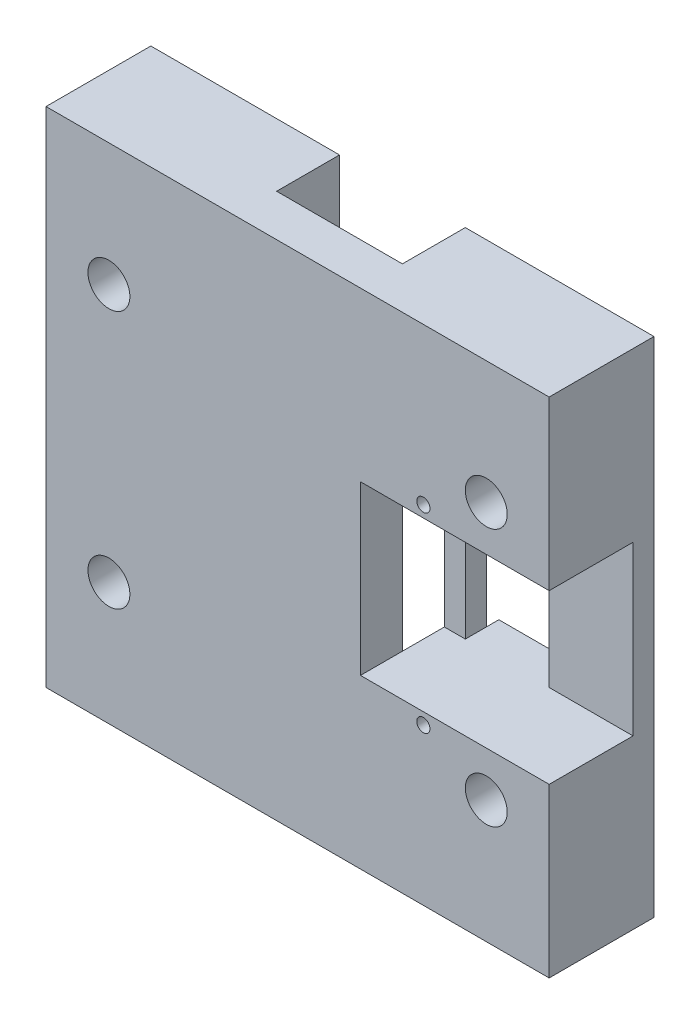
ISO-10303-21;
HEADER;
FILE_DESCRIPTION(('STEP AP214'),'2;1');
FILE_NAME('part.step','',(''),(''),'','','');
FILE_SCHEMA(('AUTOMOTIVE_DESIGN { 1 0 10303 214 1 1 1 1 }'));
ENDSEC;
DATA;
#1=APPLICATION_CONTEXT('core data for automotive mechanical design processes');
#2=APPLICATION_PROTOCOL_DEFINITION('international standard','automotive_design',2000,#1);
#3=PRODUCT_CONTEXT('',#1,'mechanical');
#4=PRODUCT('Part','Part','',(#3));
#5=PRODUCT_RELATED_PRODUCT_CATEGORY('part','',(#4));
#6=PRODUCT_DEFINITION_FORMATION('','',#4);
#7=PRODUCT_DEFINITION_CONTEXT('part definition',#1,'design');
#8=PRODUCT_DEFINITION('design','',#6,#7);
#9=PRODUCT_DEFINITION_SHAPE('','',#8);
#10=(LENGTH_UNIT() NAMED_UNIT(*) SI_UNIT(.MILLI.,.METRE.));
#11=(NAMED_UNIT(*) PLANE_ANGLE_UNIT() SI_UNIT($,.RADIAN.));
#12=(NAMED_UNIT(*) SI_UNIT($,.STERADIAN.) SOLID_ANGLE_UNIT());
#13=UNCERTAINTY_MEASURE_WITH_UNIT(LENGTH_MEASURE(1.E-05),#10,'distance_accuracy_value','');
#14=(GEOMETRIC_REPRESENTATION_CONTEXT(3) GLOBAL_UNCERTAINTY_ASSIGNED_CONTEXT((#13)) GLOBAL_UNIT_ASSIGNED_CONTEXT((#10,
#11,#12)) REPRESENTATION_CONTEXT('',''));
#15=CARTESIAN_POINT('',(0.,0.,0.));
#16=DIRECTION('',(0.,0.,1.));
#17=DIRECTION('',(1.,0.,0.));
#18=AXIS2_PLACEMENT_3D('',#15,#16,#17);
#19=CARTESIAN_POINT('',(25.4,16.1999999999999,0.));
#20=DIRECTION('',(1.,0.,0.));
#21=DIRECTION('',(0.,0.,-1.));
#22=AXIS2_PLACEMENT_3D('',#19,#20,#21);
#23=PLANE('',#22);
#24=DIRECTION('',(0.,0.,1.));
#25=VECTOR('',#24,1.);
#26=CARTESIAN_POINT('',(25.4,12.7,-11.43));
#27=LINE('',#26,#25);
#28=CARTESIAN_POINT('',(25.4,12.7,-9.525));
#29=VERTEX_POINT('',#28);
#30=CARTESIAN_POINT('',(25.4,12.7,-6.35));
#31=VERTEX_POINT('',#30);
#32=EDGE_CURVE('E764',#29,#31,#27,.T.);
#33=ORIENTED_EDGE('',*,*,#32,.F.);
#34=DIRECTION('',(0.,-1.,0.));
#35=VECTOR('',#34,1.);
#36=CARTESIAN_POINT('',(25.4,16.1999999999999,-9.525));
#37=LINE('',#36,#35);
#38=CARTESIAN_POINT('',(25.4,-12.7,-9.525));
#39=VERTEX_POINT('',#38);
#40=EDGE_CURVE('E278',#29,#39,#37,.T.);
#41=ORIENTED_EDGE('',*,*,#40,.T.);
#42=DIRECTION('',(0.,0.,1.));
#43=VECTOR('',#42,1.);
#44=CARTESIAN_POINT('',(25.4,-12.7,-11.43));
#45=LINE('',#44,#43);
#46=CARTESIAN_POINT('',(25.4,-12.7,-6.35));
#47=VERTEX_POINT('',#46);
#48=EDGE_CURVE('E264',#39,#47,#45,.T.);
#49=ORIENTED_EDGE('',*,*,#48,.T.);
#50=DIRECTION('',(0.,-1.,0.));
#51=VECTOR('',#50,1.);
#52=CARTESIAN_POINT('',(25.4,12.7,-6.35));
#53=LINE('',#52,#51);
#54=EDGE_CURVE('E299',#31,#47,#53,.T.);
#55=ORIENTED_EDGE('',*,*,#54,.F.);
#56=EDGE_LOOP('',(#33,#41,#49,#55));
#57=FACE_BOUND('',#56,.T.);
#58=ADVANCED_FACE('F41',(#57),#23,.F.);
#59=CARTESIAN_POINT('',(12.7,16.1999999999999,0.));
#60=DIRECTION('',(-1.,0.,0.));
#61=DIRECTION('',(0.,0.,1.));
#62=AXIS2_PLACEMENT_3D('',#59,#60,#61);
#63=PLANE('',#62);
#64=DIRECTION('',(0.,0.,1.));
#65=VECTOR('',#64,1.);
#66=CARTESIAN_POINT('',(12.7,12.7,-11.43));
#67=LINE('',#66,#65);
#68=CARTESIAN_POINT('',(12.7,12.7,-9.525));
#69=VERTEX_POINT('',#68);
#70=CARTESIAN_POINT('',(12.7,12.7,-6.35));
#71=VERTEX_POINT('',#70);
#72=EDGE_CURVE('E224',#69,#71,#67,.T.);
#73=ORIENTED_EDGE('',*,*,#72,.T.);
#74=DIRECTION('',(0.,1.,0.));
#75=VECTOR('',#74,1.);
#76=CARTESIAN_POINT('',(12.7,12.7,-6.35));
#77=LINE('',#76,#75);
#78=CARTESIAN_POINT('',(12.7,-12.7,-6.35));
#79=VERTEX_POINT('',#78);
#80=EDGE_CURVE('E295',#79,#71,#77,.T.);
#81=ORIENTED_EDGE('',*,*,#80,.F.);
#82=DIRECTION('',(0.,0.,1.));
#83=VECTOR('',#82,1.);
#84=CARTESIAN_POINT('',(12.7,-12.7,-11.43));
#85=LINE('',#84,#83);
#86=CARTESIAN_POINT('',(12.7,-12.7,-9.525));
#87=VERTEX_POINT('',#86);
#88=EDGE_CURVE('E251',#87,#79,#85,.T.);
#89=ORIENTED_EDGE('',*,*,#88,.F.);
#90=DIRECTION('',(0.,1.,0.));
#91=VECTOR('',#90,1.);
#92=CARTESIAN_POINT('',(12.7,16.1999999999999,-9.525));
#93=LINE('',#92,#91);
#94=EDGE_CURVE('E288',#87,#69,#93,.T.);
#95=ORIENTED_EDGE('',*,*,#94,.T.);
#96=EDGE_LOOP('',(#73,#81,#89,#95));
#97=FACE_BOUND('',#96,.T.);
#98=ADVANCED_FACE('F529',(#97),#63,.F.);
#99=CARTESIAN_POINT('',(66.4980633142473,12.7,-6.35));
#100=DIRECTION('',(0.,0.,-1.));
#101=DIRECTION('',(-1.,0.,0.));
#102=AXIS2_PLACEMENT_3D('',#99,#100,#101);
#103=PLANE('',#102);
#104=DIRECTION('',(-1.,0.,0.));
#105=VECTOR('',#104,1.);
#106=CARTESIAN_POINT('',(66.4980633142473,12.7,-6.35));
#107=LINE('',#106,#105);
#108=CARTESIAN_POINT('',(38.1,12.7,-6.35));
#109=VERTEX_POINT('',#108);
#110=EDGE_CURVE('E308',#109,#31,#107,.T.);
#111=ORIENTED_EDGE('',*,*,#110,.T.);
#112=ORIENTED_EDGE('',*,*,#54,.T.);
#113=DIRECTION('',(-1.,0.,0.));
#114=VECTOR('',#113,1.);
#115=CARTESIAN_POINT('',(66.4980633142473,-12.7,-6.35));
#116=LINE('',#115,#114);
#117=CARTESIAN_POINT('',(38.1,-12.7,-6.35));
#118=VERTEX_POINT('',#117);
#119=EDGE_CURVE('E335',#118,#47,#116,.T.);
#120=ORIENTED_EDGE('',*,*,#119,.F.);
#121=DIRECTION('',(0.,1.,0.));
#122=VECTOR('',#121,1.);
#123=CARTESIAN_POINT('',(38.1,12.7,-6.35));
#124=LINE('',#123,#122);
#125=EDGE_CURVE('E307',#118,#109,#124,.T.);
#126=ORIENTED_EDGE('',*,*,#125,.T.);
#127=EDGE_LOOP('',(#111,#112,#120,#126));
#128=FACE_BOUND('',#127,.T.);
#129=ADVANCED_FACE('F537',(#128),#103,.F.);
#130=CARTESIAN_POINT('',(0.,0.,0.));
#131=DIRECTION('',(0.,0.,-1.));
#132=DIRECTION('',(-1.,0.,0.));
#133=AXIS2_PLACEMENT_3D('',#130,#131,#132);
#134=PLANE('',#133);
#135=DIRECTION('',(1.,0.,0.));
#136=VECTOR('',#135,1.);
#137=CARTESIAN_POINT('',(38.1,-38.1,0.));
#138=LINE('',#137,#136);
#139=CARTESIAN_POINT('',(-9.525,-38.1,0.));
#140=VERTEX_POINT('',#139);
#141=CARTESIAN_POINT('',(9.52500000000001,-38.1,0.));
#142=VERTEX_POINT('',#141);
#143=EDGE_CURVE('E426',#140,#142,#138,.T.);
#144=ORIENTED_EDGE('',*,*,#143,.F.);
#145=DIRECTION('',(0.,-1.,0.));
#146=VECTOR('',#145,1.);
#147=CARTESIAN_POINT('',(-9.525,0.,0.));
#148=LINE('',#147,#146);
#149=CARTESIAN_POINT('',(-9.525,38.1,0.));
#150=VERTEX_POINT('',#149);
#151=EDGE_CURVE('E341',#150,#140,#148,.T.);
#152=ORIENTED_EDGE('',*,*,#151,.F.);
#153=DIRECTION('',(-1.,0.,0.));
#154=VECTOR('',#153,1.);
#155=CARTESIAN_POINT('',(38.1,38.1,0.));
#156=LINE('',#155,#154);
#157=CARTESIAN_POINT('',(9.525,38.1,0.));
#158=VERTEX_POINT('',#157);
#159=EDGE_CURVE('E432',#158,#150,#156,.T.);
#160=ORIENTED_EDGE('',*,*,#159,.F.);
#161=DIRECTION('',(0.,-1.,0.));
#162=VECTOR('',#161,1.);
#163=CARTESIAN_POINT('',(9.525,0.,0.));
#164=LINE('',#163,#162);
#165=CARTESIAN_POINT('',(9.525,12.7,0.));
#166=VERTEX_POINT('',#165);
#167=EDGE_CURVE('E380',#158,#166,#164,.T.);
#168=ORIENTED_EDGE('',*,*,#167,.T.);
#169=CARTESIAN_POINT('',(9.525,-12.7,0.));
#170=VERTEX_POINT('',#169);
#171=EDGE_CURVE('E403',#166,#170,#164,.T.);
#172=ORIENTED_EDGE('',*,*,#171,.T.);
#173=EDGE_CURVE('E374',#170,#142,#164,.T.);
#174=ORIENTED_EDGE('',*,*,#173,.T.);
#175=EDGE_LOOP('',(#144,#152,#160,#168,#172,#174));
#176=FACE_BOUND('',#175,.T.);
#177=ADVANCED_FACE('F481',(#176),#134,.T.);
#178=CARTESIAN_POINT('',(0.,0.,6.35));
#179=DIRECTION('',(0.,0.,-1.));
#180=DIRECTION('',(-1.,0.,0.));
#181=AXIS2_PLACEMENT_3D('',#178,#179,#180);
#182=PLANE('',#181);
#183=CARTESIAN_POINT('',(19.05,14.45,6.35));
#184=DIRECTION('',(0.,0.,-1.));
#185=DIRECTION('',(-1.,0.,0.));
#186=AXIS2_PLACEMENT_3D('',#183,#184,#185);
#187=CIRCLE('',#186,1.);
#188=CARTESIAN_POINT('',(18.05,14.45,6.35));
#189=VERTEX_POINT('',#188);
#190=EDGE_CURVE('E274',#189,#189,#187,.F.);
#191=ORIENTED_EDGE('',*,*,#190,.F.);
#192=EDGE_LOOP('',(#191));
#193=FACE_BOUND('',#192,.T.);
#194=CARTESIAN_POINT('',(19.05,-14.45,6.35));
#195=DIRECTION('',(0.,0.,-1.));
#196=DIRECTION('',(-1.,0.,0.));
#197=AXIS2_PLACEMENT_3D('',#194,#195,#196);
#198=CIRCLE('',#197,1.);
#199=CARTESIAN_POINT('',(18.05,-14.45,6.35));
#200=VERTEX_POINT('',#199);
#201=EDGE_CURVE('E273',#200,#200,#198,.F.);
#202=ORIENTED_EDGE('',*,*,#201,.F.);
#203=EDGE_LOOP('',(#202));
#204=FACE_BOUND('',#203,.T.);
#205=DIRECTION('',(0.,1.,0.));
#206=VECTOR('',#205,1.);
#207=CARTESIAN_POINT('',(9.525,12.7,6.35));
#208=LINE('',#207,#206);
#209=CARTESIAN_POINT('',(9.525,-12.7,6.35));
#210=VERTEX_POINT('',#209);
#211=CARTESIAN_POINT('',(9.525,12.7,6.35));
#212=VERTEX_POINT('',#211);
#213=EDGE_CURVE('E318',#210,#212,#208,.T.);
#214=ORIENTED_EDGE('',*,*,#213,.T.);
#215=DIRECTION('',(-1.,0.,0.));
#216=VECTOR('',#215,1.);
#217=CARTESIAN_POINT('',(66.4980633142473,12.7,6.35));
#218=LINE('',#217,#216);
#219=CARTESIAN_POINT('',(38.1,12.7,6.35));
#220=VERTEX_POINT('',#219);
#221=EDGE_CURVE('E330',#220,#212,#218,.T.);
#222=ORIENTED_EDGE('',*,*,#221,.F.);
#223=DIRECTION('',(0.,1.,0.));
#224=VECTOR('',#223,1.);
#225=CARTESIAN_POINT('',(38.1,38.1,6.35));
#226=LINE('',#225,#224);
#227=CARTESIAN_POINT('',(38.1,38.1,6.35));
#228=VERTEX_POINT('',#227);
#229=EDGE_CURVE('E435',#220,#228,#226,.T.);
#230=ORIENTED_EDGE('',*,*,#229,.T.);
#231=DIRECTION('',(-1.,0.,0.));
#232=VECTOR('',#231,1.);
#233=CARTESIAN_POINT('',(38.1,38.1,6.35));
#234=LINE('',#233,#232);
#235=CARTESIAN_POINT('',(-38.1,38.1,6.35));
#236=VERTEX_POINT('',#235);
#237=EDGE_CURVE('E440',#228,#236,#234,.T.);
#238=ORIENTED_EDGE('',*,*,#237,.T.);
#239=DIRECTION('',(0.,-1.,0.));
#240=VECTOR('',#239,1.);
#241=CARTESIAN_POINT('',(-38.1,38.1,6.35));
#242=LINE('',#241,#240);
#243=CARTESIAN_POINT('',(-38.1,-38.1,6.35));
#244=VERTEX_POINT('',#243);
#245=EDGE_CURVE('E427',#236,#244,#242,.T.);
#246=ORIENTED_EDGE('',*,*,#245,.T.);
#247=DIRECTION('',(1.,0.,0.));
#248=VECTOR('',#247,1.);
#249=CARTESIAN_POINT('',(38.1,-38.1,6.35));
#250=LINE('',#249,#248);
#251=CARTESIAN_POINT('',(38.1,-38.1,6.35));
#252=VERTEX_POINT('',#251);
#253=EDGE_CURVE('E431',#244,#252,#250,.T.);
#254=ORIENTED_EDGE('',*,*,#253,.T.);
#255=CARTESIAN_POINT('',(38.1,-12.7,6.35));
#256=VERTEX_POINT('',#255);
#257=EDGE_CURVE('E436',#252,#256,#226,.T.);
#258=ORIENTED_EDGE('',*,*,#257,.T.);
#259=DIRECTION('',(-1.,0.,0.));
#260=VECTOR('',#259,1.);
#261=CARTESIAN_POINT('',(66.4980633142473,-12.7,6.35));
#262=LINE('',#261,#260);
#263=EDGE_CURVE('E57',#256,#210,#262,.T.);
#264=ORIENTED_EDGE('',*,*,#263,.T.);
#265=EDGE_LOOP('',(#214,#222,#230,#238,#246,#254,#258,#264));
#266=FACE_BOUND('',#265,.T.);
#267=CARTESIAN_POINT('',(-28.575,19.525,6.35));
#268=DIRECTION('',(0.,0.,1.));
#269=DIRECTION('',(1.,0.,0.));
#270=AXIS2_PLACEMENT_3D('',#267,#268,#269);
#271=CIRCLE('',#270,3.175);
#272=CARTESIAN_POINT('',(-25.4,19.525,6.35));
#273=VERTEX_POINT('',#272);
#274=EDGE_CURVE('E422',#273,#273,#271,.T.);
#275=ORIENTED_EDGE('',*,*,#274,.F.);
#276=EDGE_LOOP('',(#275));
#277=FACE_BOUND('',#276,.T.);
#278=CARTESIAN_POINT('',(28.575,19.525,6.35));
#279=DIRECTION('',(0.,0.,1.));
#280=DIRECTION('',(1.,0.,0.));
#281=AXIS2_PLACEMENT_3D('',#278,#279,#280);
#282=CIRCLE('',#281,3.175);
#283=CARTESIAN_POINT('',(31.75,19.525,6.35));
#284=VERTEX_POINT('',#283);
#285=EDGE_CURVE('E418',#284,#284,#282,.T.);
#286=ORIENTED_EDGE('',*,*,#285,.F.);
#287=EDGE_LOOP('',(#286));
#288=FACE_BOUND('',#287,.T.);
#289=CARTESIAN_POINT('',(28.575,-19.525,6.35));
#290=DIRECTION('',(0.,0.,1.));
#291=DIRECTION('',(1.,0.,0.));
#292=AXIS2_PLACEMENT_3D('',#289,#290,#291);
#293=CIRCLE('',#292,3.175);
#294=CARTESIAN_POINT('',(31.75,-19.525,6.35));
#295=VERTEX_POINT('',#294);
#296=EDGE_CURVE('E414',#295,#295,#293,.T.);
#297=ORIENTED_EDGE('',*,*,#296,.F.);
#298=EDGE_LOOP('',(#297));
#299=FACE_BOUND('',#298,.T.);
#300=CARTESIAN_POINT('',(-28.575,-19.525,6.35));
#301=DIRECTION('',(0.,0.,1.));
#302=DIRECTION('',(1.,0.,0.));
#303=AXIS2_PLACEMENT_3D('',#300,#301,#302);
#304=CIRCLE('',#303,3.175);
#305=CARTESIAN_POINT('',(-25.4,-19.525,6.35));
#306=VERTEX_POINT('',#305);
#307=EDGE_CURVE('E410',#306,#306,#304,.T.);
#308=ORIENTED_EDGE('',*,*,#307,.F.);
#309=EDGE_LOOP('',(#308));
#310=FACE_BOUND('',#309,.T.);
#311=ADVANCED_FACE('F503',(#193,#204,#266,#277,#288,#299,#310),#182,.F.);
#312=CARTESIAN_POINT('',(-38.1,38.1,6.35));
#313=DIRECTION('',(1.,0.,0.));
#314=DIRECTION('',(0.,1.,0.));
#315=AXIS2_PLACEMENT_3D('',#312,#313,#314);
#316=PLANE('',#315);
#317=DIRECTION('',(0.,0.,-1.));
#318=VECTOR('',#317,1.);
#319=CARTESIAN_POINT('',(-38.1,38.1,6.35));
#320=LINE('',#319,#318);
#321=CARTESIAN_POINT('',(-38.1,38.1,-9.525));
#322=VERTEX_POINT('',#321);
#323=EDGE_CURVE('E443',#236,#322,#320,.T.);
#324=ORIENTED_EDGE('',*,*,#323,.T.);
#325=DIRECTION('',(0.,1.,0.));
#326=VECTOR('',#325,1.);
#327=CARTESIAN_POINT('',(-38.1,0.,-9.525));
#328=LINE('',#327,#326);
#329=CARTESIAN_POINT('',(-38.1,-38.1,-9.525));
#330=VERTEX_POINT('',#329);
#331=EDGE_CURVE('E361',#330,#322,#328,.T.);
#332=ORIENTED_EDGE('',*,*,#331,.F.);
#333=DIRECTION('',(0.,0.,-1.));
#334=VECTOR('',#333,1.);
#335=CARTESIAN_POINT('',(-38.1,-38.1,6.35));
#336=LINE('',#335,#334);
#337=EDGE_CURVE('E50',#244,#330,#336,.T.);
#338=ORIENTED_EDGE('',*,*,#337,.F.);
#339=ORIENTED_EDGE('',*,*,#245,.F.);
#340=EDGE_LOOP('',(#324,#332,#338,#339));
#341=FACE_BOUND('',#340,.T.);
#342=ADVANCED_FACE('F43',(#341),#316,.F.);
#343=CARTESIAN_POINT('',(38.1,-38.1,6.35));
#344=DIRECTION('',(0.,1.,0.));
#345=DIRECTION('',(-1.,0.,0.));
#346=AXIS2_PLACEMENT_3D('',#343,#344,#345);
#347=PLANE('',#346);
#348=ORIENTED_EDGE('',*,*,#337,.T.);
#349=DIRECTION('',(-1.,0.,0.));
#350=VECTOR('',#349,1.);
#351=CARTESIAN_POINT('',(0.,-38.1,-9.525));
#352=LINE('',#351,#350);
#353=CARTESIAN_POINT('',(-9.525,-38.1,-9.525));
#354=VERTEX_POINT('',#353);
#355=EDGE_CURVE('E357',#354,#330,#352,.T.);
#356=ORIENTED_EDGE('',*,*,#355,.F.);
#357=DIRECTION('',(0.,0.,1.));
#358=VECTOR('',#357,1.);
#359=CARTESIAN_POINT('',(-9.525,-38.1,-9.525));
#360=LINE('',#359,#358);
#361=EDGE_CURVE('E365',#354,#140,#360,.T.);
#362=ORIENTED_EDGE('',*,*,#361,.T.);
#363=ORIENTED_EDGE('',*,*,#143,.T.);
#364=DIRECTION('',(0.,0.,1.));
#365=VECTOR('',#364,1.);
#366=CARTESIAN_POINT('',(9.525,-38.1,-9.525));
#367=LINE('',#366,#365);
#368=CARTESIAN_POINT('',(9.525,-38.1,-9.525));
#369=VERTEX_POINT('',#368);
#370=EDGE_CURVE('E399',#369,#142,#367,.T.);
#371=ORIENTED_EDGE('',*,*,#370,.F.);
#372=DIRECTION('',(-1.,0.,0.));
#373=VECTOR('',#372,1.);
#374=CARTESIAN_POINT('',(0.,-38.1,-9.525));
#375=LINE('',#374,#373);
#376=CARTESIAN_POINT('',(38.1,-38.1,-9.525));
#377=VERTEX_POINT('',#376);
#378=EDGE_CURVE('E388',#377,#369,#375,.T.);
#379=ORIENTED_EDGE('',*,*,#378,.F.);
#380=DIRECTION('',(0.,0.,-1.));
#381=VECTOR('',#380,1.);
#382=CARTESIAN_POINT('',(38.1,-38.1,6.35));
#383=LINE('',#382,#381);
#384=EDGE_CURVE('E455',#252,#377,#383,.T.);
#385=ORIENTED_EDGE('',*,*,#384,.F.);
#386=ORIENTED_EDGE('',*,*,#253,.F.);
#387=EDGE_LOOP('',(#348,#356,#362,#363,#371,#379,#385,#386));
#388=FACE_BOUND('',#387,.T.);
#389=ADVANCED_FACE('F461',(#388),#347,.F.);
#390=CARTESIAN_POINT('',(38.1,38.1,6.35));
#391=DIRECTION('',(-1.,0.,0.));
#392=DIRECTION('',(0.,-1.,0.));
#393=AXIS2_PLACEMENT_3D('',#390,#391,#392);
#394=PLANE('',#393);
#395=ORIENTED_EDGE('',*,*,#229,.F.);
#396=DIRECTION('',(0.,0.,1.));
#397=VECTOR('',#396,1.);
#398=CARTESIAN_POINT('',(38.1,12.7,6.35));
#399=LINE('',#398,#397);
#400=EDGE_CURVE('E304',#109,#220,#399,.T.);
#401=ORIENTED_EDGE('',*,*,#400,.F.);
#402=ORIENTED_EDGE('',*,*,#125,.F.);
#403=DIRECTION('',(0.,0.,-1.));
#404=VECTOR('',#403,1.);
#405=CARTESIAN_POINT('',(38.1,-12.7,6.35));
#406=LINE('',#405,#404);
#407=EDGE_CURVE('E311',#256,#118,#406,.T.);
#408=ORIENTED_EDGE('',*,*,#407,.F.);
#409=ORIENTED_EDGE('',*,*,#257,.F.);
#410=ORIENTED_EDGE('',*,*,#384,.T.);
#411=DIRECTION('',(0.,-1.,0.));
#412=VECTOR('',#411,1.);
#413=CARTESIAN_POINT('',(38.1,0.,-9.525));
#414=LINE('',#413,#412);
#415=CARTESIAN_POINT('',(38.1,38.1,-9.525));
#416=VERTEX_POINT('',#415);
#417=EDGE_CURVE('E384',#416,#377,#414,.T.);
#418=ORIENTED_EDGE('',*,*,#417,.F.);
#419=DIRECTION('',(0.,0.,-1.));
#420=VECTOR('',#419,1.);
#421=CARTESIAN_POINT('',(38.1,38.1,6.35));
#422=LINE('',#421,#420);
#423=EDGE_CURVE('E452',#228,#416,#422,.T.);
#424=ORIENTED_EDGE('',*,*,#423,.F.);
#425=EDGE_LOOP('',(#395,#401,#402,#408,#409,#410,#418,#424));
#426=FACE_BOUND('',#425,.T.);
#427=ADVANCED_FACE('F500',(#426),#394,.F.);
#428=CARTESIAN_POINT('',(38.1,38.1,6.35));
#429=DIRECTION('',(0.,-1.,0.));
#430=DIRECTION('',(1.,0.,0.));
#431=AXIS2_PLACEMENT_3D('',#428,#429,#430);
#432=PLANE('',#431);
#433=ORIENTED_EDGE('',*,*,#423,.T.);
#434=DIRECTION('',(1.,0.,0.));
#435=VECTOR('',#434,1.);
#436=CARTESIAN_POINT('',(0.,38.1,-9.525));
#437=LINE('',#436,#435);
#438=CARTESIAN_POINT('',(9.525,38.1,-9.525));
#439=VERTEX_POINT('',#438);
#440=EDGE_CURVE('E379',#439,#416,#437,.T.);
#441=ORIENTED_EDGE('',*,*,#440,.F.);
#442=DIRECTION('',(0.,0.,1.));
#443=VECTOR('',#442,1.);
#444=CARTESIAN_POINT('',(9.525,38.1,-9.525));
#445=LINE('',#444,#443);
#446=EDGE_CURVE('E407',#439,#158,#445,.T.);
#447=ORIENTED_EDGE('',*,*,#446,.T.);
#448=ORIENTED_EDGE('',*,*,#159,.T.);
#449=DIRECTION('',(0.,0.,1.));
#450=VECTOR('',#449,1.);
#451=CARTESIAN_POINT('',(-9.525,38.1,-9.525));
#452=LINE('',#451,#450);
#453=CARTESIAN_POINT('',(-9.525,38.1,-9.525));
#454=VERTEX_POINT('',#453);
#455=EDGE_CURVE('E371',#454,#150,#452,.T.);
#456=ORIENTED_EDGE('',*,*,#455,.F.);
#457=DIRECTION('',(1.,0.,0.));
#458=VECTOR('',#457,1.);
#459=CARTESIAN_POINT('',(0.,38.1,-9.525));
#460=LINE('',#459,#458);
#461=EDGE_CURVE('E350',#322,#454,#460,.T.);
#462=ORIENTED_EDGE('',*,*,#461,.F.);
#463=ORIENTED_EDGE('',*,*,#323,.F.);
#464=ORIENTED_EDGE('',*,*,#237,.F.);
#465=EDGE_LOOP('',(#433,#441,#447,#448,#456,#462,#463,#464));
#466=FACE_BOUND('',#465,.T.);
#467=ADVANCED_FACE('F473',(#466),#432,.F.);
#468=CARTESIAN_POINT('',(-28.575,19.525,6.35));
#469=DIRECTION('',(0.,0.,-1.));
#470=DIRECTION('',(-1.,0.,0.));
#471=AXIS2_PLACEMENT_3D('',#468,#469,#470);
#472=CYLINDRICAL_SURFACE('',#471,3.175);
#473=ORIENTED_EDGE('',*,*,#274,.T.);
#474=EDGE_LOOP('',(#473));
#475=FACE_BOUND('',#474,.T.);
#476=CARTESIAN_POINT('',(-28.575,19.525,-9.525));
#477=DIRECTION('',(0.,0.,-1.));
#478=DIRECTION('',(-1.,0.,0.));
#479=AXIS2_PLACEMENT_3D('',#476,#477,#478);
#480=CIRCLE('',#479,3.175);
#481=CARTESIAN_POINT('',(-31.75,19.525,-9.525));
#482=VERTEX_POINT('',#481);
#483=EDGE_CURVE('E346',#482,#482,#480,.F.);
#484=ORIENTED_EDGE('',*,*,#483,.F.);
#485=EDGE_LOOP('',(#484));
#486=FACE_BOUND('',#485,.T.);
#487=ADVANCED_FACE('F610',(#475,#486),#472,.F.);
#488=CARTESIAN_POINT('',(28.575,19.525,6.35));
#489=DIRECTION('',(0.,0.,-1.));
#490=DIRECTION('',(-1.,0.,0.));
#491=AXIS2_PLACEMENT_3D('',#488,#489,#490);
#492=CYLINDRICAL_SURFACE('',#491,3.175);
#493=ORIENTED_EDGE('',*,*,#285,.T.);
#494=EDGE_LOOP('',(#493));
#495=FACE_BOUND('',#494,.T.);
#496=CARTESIAN_POINT('',(28.575,19.525,-9.525));
#497=DIRECTION('',(0.,0.,-1.));
#498=DIRECTION('',(-1.,0.,0.));
#499=AXIS2_PLACEMENT_3D('',#496,#497,#498);
#500=CIRCLE('',#499,3.175);
#501=CARTESIAN_POINT('',(25.4,19.525,-9.525));
#502=VERTEX_POINT('',#501);
#503=EDGE_CURVE('E391',#502,#502,#500,.F.);
#504=ORIENTED_EDGE('',*,*,#503,.F.);
#505=EDGE_LOOP('',(#504));
#506=FACE_BOUND('',#505,.T.);
#507=ADVANCED_FACE('F606',(#495,#506),#492,.F.);
#508=CARTESIAN_POINT('',(28.575,-19.525,6.35));
#509=DIRECTION('',(0.,0.,-1.));
#510=DIRECTION('',(-1.,0.,0.));
#511=AXIS2_PLACEMENT_3D('',#508,#509,#510);
#512=CYLINDRICAL_SURFACE('',#511,3.175);
#513=ORIENTED_EDGE('',*,*,#296,.T.);
#514=EDGE_LOOP('',(#513));
#515=FACE_BOUND('',#514,.T.);
#516=CARTESIAN_POINT('',(28.575,-19.525,-9.525));
#517=DIRECTION('',(0.,0.,-1.));
#518=DIRECTION('',(-1.,0.,0.));
#519=AXIS2_PLACEMENT_3D('',#516,#517,#518);
#520=CIRCLE('',#519,3.175);
#521=CARTESIAN_POINT('',(25.4,-19.525,-9.525));
#522=VERTEX_POINT('',#521);
#523=EDGE_CURVE('E395',#522,#522,#520,.F.);
#524=ORIENTED_EDGE('',*,*,#523,.F.);
#525=EDGE_LOOP('',(#524));
#526=FACE_BOUND('',#525,.T.);
#527=ADVANCED_FACE('F602',(#515,#526),#512,.F.);
#528=CARTESIAN_POINT('',(-28.575,-19.525,6.35));
#529=DIRECTION('',(0.,0.,-1.));
#530=DIRECTION('',(-1.,0.,0.));
#531=AXIS2_PLACEMENT_3D('',#528,#529,#530);
#532=CYLINDRICAL_SURFACE('',#531,3.175);
#533=ORIENTED_EDGE('',*,*,#307,.T.);
#534=EDGE_LOOP('',(#533));
#535=FACE_BOUND('',#534,.T.);
#536=CARTESIAN_POINT('',(-28.575,-19.525,-9.525));
#537=DIRECTION('',(0.,0.,-1.));
#538=DIRECTION('',(-1.,0.,0.));
#539=AXIS2_PLACEMENT_3D('',#536,#537,#538);
#540=CIRCLE('',#539,3.175);
#541=CARTESIAN_POINT('',(-31.75,-19.525,-9.525));
#542=VERTEX_POINT('',#541);
#543=EDGE_CURVE('E342',#542,#542,#540,.F.);
#544=ORIENTED_EDGE('',*,*,#543,.F.);
#545=EDGE_LOOP('',(#544));
#546=FACE_BOUND('',#545,.T.);
#547=ADVANCED_FACE('F599',(#535,#546),#532,.F.);
#548=CARTESIAN_POINT('',(9.525,0.,-9.525));
#549=DIRECTION('',(-1.,0.,0.));
#550=DIRECTION('',(0.,0.,1.));
#551=AXIS2_PLACEMENT_3D('',#548,#549,#550);
#552=PLANE('',#551);
#553=DIRECTION('',(0.,0.,-1.));
#554=VECTOR('',#553,1.);
#555=CARTESIAN_POINT('',(9.525,12.7,-9.525));
#556=LINE('',#555,#554);
#557=CARTESIAN_POINT('',(9.525,12.7,-6.35));
#558=VERTEX_POINT('',#557);
#559=EDGE_CURVE('E11',#166,#558,#556,.T.);
#560=ORIENTED_EDGE('',*,*,#559,.F.);
#561=ORIENTED_EDGE('',*,*,#167,.F.);
#562=ORIENTED_EDGE('',*,*,#446,.F.);
#563=DIRECTION('',(0.,-1.,0.));
#564=VECTOR('',#563,1.);
#565=CARTESIAN_POINT('',(9.525,0.,-9.525));
#566=LINE('',#565,#564);
#567=EDGE_CURVE('E375',#439,#369,#566,.T.);
#568=ORIENTED_EDGE('',*,*,#567,.T.);
#569=ORIENTED_EDGE('',*,*,#370,.T.);
#570=ORIENTED_EDGE('',*,*,#173,.F.);
#571=DIRECTION('',(0.,0.,1.));
#572=VECTOR('',#571,1.);
#573=CARTESIAN_POINT('',(9.525,-12.7,6.35));
#574=LINE('',#573,#572);
#575=CARTESIAN_POINT('',(9.525,-12.7,-6.35));
#576=VERTEX_POINT('',#575);
#577=EDGE_CURVE('E315',#576,#170,#574,.T.);
#578=ORIENTED_EDGE('',*,*,#577,.F.);
#579=DIRECTION('',(0.,-1.,0.));
#580=VECTOR('',#579,1.);
#581=CARTESIAN_POINT('',(9.525,12.7,-6.35));
#582=LINE('',#581,#580);
#583=EDGE_CURVE('E303',#558,#576,#582,.T.);
#584=ORIENTED_EDGE('',*,*,#583,.F.);
#585=EDGE_LOOP('',(#560,#561,#562,#568,#569,#570,#578,#584));
#586=FACE_BOUND('',#585,.T.);
#587=ADVANCED_FACE('F488',(#586),#552,.T.);
#588=CARTESIAN_POINT('',(0.,0.,-9.525));
#589=DIRECTION('',(0.,0.,-1.));
#590=DIRECTION('',(-1.,0.,0.));
#591=AXIS2_PLACEMENT_3D('',#588,#589,#590);
#592=PLANE('',#591);
#593=CARTESIAN_POINT('',(25.4,16.1999999999999,-9.525));
#594=VERTEX_POINT('',#593);
#595=EDGE_CURVE('E282',#594,#29,#37,.T.);
#596=ORIENTED_EDGE('',*,*,#595,.F.);
#597=DIRECTION('',(1.,0.,0.));
#598=VECTOR('',#597,1.);
#599=CARTESIAN_POINT('',(12.7,16.1999999999999,-9.525));
#600=LINE('',#599,#598);
#601=CARTESIAN_POINT('',(12.7,16.1999999999999,-9.525));
#602=VERTEX_POINT('',#601);
#603=EDGE_CURVE('E292',#602,#594,#600,.T.);
#604=ORIENTED_EDGE('',*,*,#603,.F.);
#605=DIRECTION('',(0.,-1.,0.));
#606=VECTOR('',#605,1.);
#607=CARTESIAN_POINT('',(12.7,0.,-9.525));
#608=LINE('',#607,#606);
#609=EDGE_CURVE('E226',#602,#69,#608,.T.);
#610=ORIENTED_EDGE('',*,*,#609,.T.);
#611=ORIENTED_EDGE('',*,*,#94,.F.);
#612=CARTESIAN_POINT('',(12.7,-16.1999999999999,-9.525));
#613=VERTEX_POINT('',#612);
#614=EDGE_CURVE('E289',#613,#87,#93,.T.);
#615=ORIENTED_EDGE('',*,*,#614,.F.);
#616=DIRECTION('',(-1.,0.,0.));
#617=VECTOR('',#616,1.);
#618=CARTESIAN_POINT('',(12.7,-16.1999999999999,-9.525));
#619=LINE('',#618,#617);
#620=CARTESIAN_POINT('',(25.4,-16.1999999999999,-9.525));
#621=VERTEX_POINT('',#620);
#622=EDGE_CURVE('E285',#621,#613,#619,.T.);
#623=ORIENTED_EDGE('',*,*,#622,.F.);
#624=DIRECTION('',(0.,1.,0.));
#625=VECTOR('',#624,1.);
#626=CARTESIAN_POINT('',(25.4,0.,-9.525));
#627=LINE('',#626,#625);
#628=EDGE_CURVE('E269',#621,#39,#627,.T.);
#629=ORIENTED_EDGE('',*,*,#628,.T.);
#630=ORIENTED_EDGE('',*,*,#40,.F.);
#631=EDGE_LOOP('',(#596,#604,#610,#611,#615,#623,#629,#630));
#632=FACE_BOUND('',#631,.T.);
#633=ORIENTED_EDGE('',*,*,#567,.F.);
#634=ORIENTED_EDGE('',*,*,#440,.T.);
#635=ORIENTED_EDGE('',*,*,#417,.T.);
#636=ORIENTED_EDGE('',*,*,#378,.T.);
#637=EDGE_LOOP('',(#633,#634,#635,#636));
#638=FACE_BOUND('',#637,.T.);
#639=ORIENTED_EDGE('',*,*,#503,.T.);
#640=EDGE_LOOP('',(#639));
#641=FACE_BOUND('',#640,.T.);
#642=ORIENTED_EDGE('',*,*,#523,.T.);
#643=EDGE_LOOP('',(#642));
#644=FACE_BOUND('',#643,.T.);
#645=ADVANCED_FACE('F494',(#632,#638,#641,#644),#592,.T.);
#646=CARTESIAN_POINT('',(-9.525,0.,-9.525));
#647=DIRECTION('',(-1.,0.,0.));
#648=DIRECTION('',(0.,0.,1.));
#649=AXIS2_PLACEMENT_3D('',#646,#647,#648);
#650=PLANE('',#649);
#651=ORIENTED_EDGE('',*,*,#151,.T.);
#652=ORIENTED_EDGE('',*,*,#361,.F.);
#653=DIRECTION('',(0.,-1.,0.));
#654=VECTOR('',#653,1.);
#655=CARTESIAN_POINT('',(-9.525,0.,-9.525));
#656=LINE('',#655,#654);
#657=EDGE_CURVE('E354',#454,#354,#656,.T.);
#658=ORIENTED_EDGE('',*,*,#657,.F.);
#659=ORIENTED_EDGE('',*,*,#455,.T.);
#660=EDGE_LOOP('',(#651,#652,#658,#659));
#661=FACE_BOUND('',#660,.T.);
#662=ADVANCED_FACE('F478',(#661),#650,.F.);
#663=CARTESIAN_POINT('',(0.,0.,-9.525));
#664=DIRECTION('',(0.,0.,-1.));
#665=DIRECTION('',(-1.,0.,0.));
#666=AXIS2_PLACEMENT_3D('',#663,#664,#665);
#667=PLANE('',#666);
#668=ORIENTED_EDGE('',*,*,#543,.T.);
#669=EDGE_LOOP('',(#668));
#670=FACE_BOUND('',#669,.T.);
#671=ORIENTED_EDGE('',*,*,#483,.T.);
#672=EDGE_LOOP('',(#671));
#673=FACE_BOUND('',#672,.T.);
#674=ORIENTED_EDGE('',*,*,#461,.T.);
#675=ORIENTED_EDGE('',*,*,#657,.T.);
#676=ORIENTED_EDGE('',*,*,#355,.T.);
#677=ORIENTED_EDGE('',*,*,#331,.T.);
#678=EDGE_LOOP('',(#674,#675,#676,#677));
#679=FACE_BOUND('',#678,.T.);
#680=ADVANCED_FACE('F467',(#670,#673,#679),#667,.T.);
#681=EDGE_CURVE('E64',#79,#576,#116,.T.);
#682=ORIENTED_EDGE('',*,*,#681,.F.);
#683=ORIENTED_EDGE('',*,*,#80,.T.);
#684=EDGE_CURVE('E329',#71,#558,#107,.T.);
#685=ORIENTED_EDGE('',*,*,#684,.T.);
#686=ORIENTED_EDGE('',*,*,#583,.T.);
#687=EDGE_LOOP('',(#682,#683,#685,#686));
#688=FACE_BOUND('',#687,.T.);
#689=ADVANCED_FACE('F531',(#688),#103,.F.);
#690=CARTESIAN_POINT('',(66.4980633142473,12.7,6.35));
#691=DIRECTION('',(0.,1.,0.));
#692=DIRECTION('',(0.,0.,1.));
#693=AXIS2_PLACEMENT_3D('',#690,#691,#692);
#694=PLANE('',#693);
#695=ORIENTED_EDGE('',*,*,#32,.T.);
#696=ORIENTED_EDGE('',*,*,#110,.F.);
#697=ORIENTED_EDGE('',*,*,#400,.T.);
#698=ORIENTED_EDGE('',*,*,#221,.T.);
#699=DIRECTION('',(0.,0.,-1.));
#700=VECTOR('',#699,1.);
#701=CARTESIAN_POINT('',(9.525,12.7,6.35));
#702=LINE('',#701,#700);
#703=EDGE_CURVE('E322',#212,#166,#702,.T.);
#704=ORIENTED_EDGE('',*,*,#703,.T.);
#705=ORIENTED_EDGE('',*,*,#559,.T.);
#706=ORIENTED_EDGE('',*,*,#684,.F.);
#707=ORIENTED_EDGE('',*,*,#72,.F.);
#708=CARTESIAN_POINT('',(12.7,12.7,-11.43));
#709=VERTEX_POINT('',#708);
#710=EDGE_CURVE('E201',#709,#69,#67,.T.);
#711=ORIENTED_EDGE('',*,*,#710,.F.);
#712=DIRECTION('',(-1.,0.,0.));
#713=VECTOR('',#712,1.);
#714=CARTESIAN_POINT('',(25.4,12.7,-11.43));
#715=LINE('',#714,#713);
#716=CARTESIAN_POINT('',(25.4,12.7,-11.43));
#717=VERTEX_POINT('',#716);
#718=EDGE_CURVE('E209',#717,#709,#715,.T.);
#719=ORIENTED_EDGE('',*,*,#718,.F.);
#720=EDGE_CURVE('E760',#717,#29,#27,.T.);
#721=ORIENTED_EDGE('',*,*,#720,.T.);
#722=EDGE_LOOP('',(#695,#696,#697,#698,#704,#705,#706,#707,#711,#719,#721));
#723=FACE_BOUND('',#722,.T.);
#724=ADVANCED_FACE('F222',(#723),#694,.F.);
#725=CARTESIAN_POINT('',(66.4980633142473,-12.7,6.35));
#726=DIRECTION('',(0.,-1.,0.));
#727=DIRECTION('',(0.,0.,-1.));
#728=AXIS2_PLACEMENT_3D('',#725,#726,#727);
#729=PLANE('',#728);
#730=ORIENTED_EDGE('',*,*,#88,.T.);
#731=ORIENTED_EDGE('',*,*,#681,.T.);
#732=ORIENTED_EDGE('',*,*,#577,.T.);
#733=EDGE_CURVE('E314',#170,#210,#574,.T.);
#734=ORIENTED_EDGE('',*,*,#733,.T.);
#735=ORIENTED_EDGE('',*,*,#263,.F.);
#736=ORIENTED_EDGE('',*,*,#407,.T.);
#737=ORIENTED_EDGE('',*,*,#119,.T.);
#738=ORIENTED_EDGE('',*,*,#48,.F.);
#739=CARTESIAN_POINT('',(25.4,-12.7,-11.43));
#740=VERTEX_POINT('',#739);
#741=EDGE_CURVE('E265',#740,#39,#45,.T.);
#742=ORIENTED_EDGE('',*,*,#741,.F.);
#743=DIRECTION('',(1.,0.,0.));
#744=VECTOR('',#743,1.);
#745=CARTESIAN_POINT('',(12.7,-12.7,-11.43));
#746=LINE('',#745,#744);
#747=CARTESIAN_POINT('',(12.7,-12.7,-11.43));
#748=VERTEX_POINT('',#747);
#749=EDGE_CURVE('E238',#748,#740,#746,.T.);
#750=ORIENTED_EDGE('',*,*,#749,.F.);
#751=EDGE_CURVE('E252',#748,#87,#85,.T.);
#752=ORIENTED_EDGE('',*,*,#751,.T.);
#753=EDGE_LOOP('',(#730,#731,#732,#734,#735,#736,#737,#738,#742,#750,#752));
#754=FACE_BOUND('',#753,.T.);
#755=ADVANCED_FACE('F524',(#754),#729,.F.);
#756=CARTESIAN_POINT('',(9.525,0.,0.));
#757=DIRECTION('',(1.,0.,0.));
#758=DIRECTION('',(0.,0.,-1.));
#759=AXIS2_PLACEMENT_3D('',#756,#757,#758);
#760=PLANE('',#759);
#761=ORIENTED_EDGE('',*,*,#703,.F.);
#762=ORIENTED_EDGE('',*,*,#213,.F.);
#763=ORIENTED_EDGE('',*,*,#733,.F.);
#764=ORIENTED_EDGE('',*,*,#171,.F.);
#765=EDGE_LOOP('',(#761,#762,#763,#764));
#766=FACE_BOUND('',#765,.T.);
#767=ADVANCED_FACE('F533',(#766),#760,.T.);
#768=CARTESIAN_POINT('',(19.05,-14.45,9.17842712474619));
#769=DIRECTION('',(0.,0.,-1.));
#770=DIRECTION('',(-1.,0.,0.));
#771=AXIS2_PLACEMENT_3D('',#768,#769,#770);
#772=CYLINDRICAL_SURFACE('',#771,1.);
#773=ORIENTED_EDGE('',*,*,#201,.T.);
#774=EDGE_LOOP('',(#773));
#775=FACE_BOUND('',#774,.T.);
#776=CARTESIAN_POINT('',(19.05,-14.45,-11.43));
#777=DIRECTION('',(0.,0.,-1.));
#778=DIRECTION('',(-1.,0.,0.));
#779=AXIS2_PLACEMENT_3D('',#776,#777,#778);
#780=CIRCLE('',#779,1.);
#781=CARTESIAN_POINT('',(18.05,-14.45,-11.43));
#782=VERTEX_POINT('',#781);
#783=EDGE_CURVE('E230',#782,#782,#780,.T.);
#784=ORIENTED_EDGE('',*,*,#783,.T.);
#785=EDGE_LOOP('',(#784));
#786=FACE_BOUND('',#785,.T.);
#787=ADVANCED_FACE('F565',(#775,#786),#772,.F.);
#788=CARTESIAN_POINT('',(19.05,14.45,9.17842712474619));
#789=DIRECTION('',(0.,0.,-1.));
#790=DIRECTION('',(-1.,0.,0.));
#791=AXIS2_PLACEMENT_3D('',#788,#789,#790);
#792=CYLINDRICAL_SURFACE('',#791,1.);
#793=ORIENTED_EDGE('',*,*,#190,.T.);
#794=EDGE_LOOP('',(#793));
#795=FACE_BOUND('',#794,.T.);
#796=CARTESIAN_POINT('',(19.05,14.45,-11.43));
#797=DIRECTION('',(0.,0.,-1.));
#798=DIRECTION('',(-1.,0.,0.));
#799=AXIS2_PLACEMENT_3D('',#796,#797,#798);
#800=CIRCLE('',#799,1.);
#801=CARTESIAN_POINT('',(18.05,14.45,-11.43));
#802=VERTEX_POINT('',#801);
#803=EDGE_CURVE('E220',#802,#802,#800,.T.);
#804=ORIENTED_EDGE('',*,*,#803,.T.);
#805=EDGE_LOOP('',(#804));
#806=FACE_BOUND('',#805,.T.);
#807=ADVANCED_FACE('F561',(#795,#806),#792,.F.);
#808=CARTESIAN_POINT('',(0.,0.,-11.43));
#809=DIRECTION('',(0.,0.,-1.));
#810=DIRECTION('',(-1.,0.,0.));
#811=AXIS2_PLACEMENT_3D('',#808,#809,#810);
#812=PLANE('',#811);
#813=ORIENTED_EDGE('',*,*,#749,.T.);
#814=DIRECTION('',(0.,-1.,0.));
#815=VECTOR('',#814,1.);
#816=CARTESIAN_POINT('',(25.4,-12.7,-11.43));
#817=LINE('',#816,#815);
#818=CARTESIAN_POINT('',(25.4,-16.1999999999999,-11.43));
#819=VERTEX_POINT('',#818);
#820=EDGE_CURVE('E242',#740,#819,#817,.T.);
#821=ORIENTED_EDGE('',*,*,#820,.T.);
#822=DIRECTION('',(-1.,0.,0.));
#823=VECTOR('',#822,1.);
#824=CARTESIAN_POINT('',(25.4,-16.1999999999999,-11.43));
#825=LINE('',#824,#823);
#826=CARTESIAN_POINT('',(12.7,-16.1999999999999,-11.43));
#827=VERTEX_POINT('',#826);
#828=EDGE_CURVE('E245',#819,#827,#825,.T.);
#829=ORIENTED_EDGE('',*,*,#828,.T.);
#830=DIRECTION('',(0.,1.,0.));
#831=VECTOR('',#830,1.);
#832=CARTESIAN_POINT('',(12.7,-16.1999999999999,-11.43));
#833=LINE('',#832,#831);
#834=EDGE_CURVE('E248',#827,#748,#833,.T.);
#835=ORIENTED_EDGE('',*,*,#834,.T.);
#836=EDGE_LOOP('',(#813,#821,#829,#835));
#837=FACE_BOUND('',#836,.T.);
#838=ORIENTED_EDGE('',*,*,#783,.F.);
#839=EDGE_LOOP('',(#838));
#840=FACE_BOUND('',#839,.T.);
#841=ADVANCED_FACE('F558',(#837,#840),#812,.T.);
#842=CARTESIAN_POINT('',(25.4,-12.7,-11.43));
#843=DIRECTION('',(-1.,0.,0.));
#844=DIRECTION('',(0.,0.,1.));
#845=AXIS2_PLACEMENT_3D('',#842,#843,#844);
#846=PLANE('',#845);
#847=ORIENTED_EDGE('',*,*,#628,.F.);
#848=DIRECTION('',(0.,0.,1.));
#849=VECTOR('',#848,1.);
#850=CARTESIAN_POINT('',(25.4,-16.1999999999999,-11.43));
#851=LINE('',#850,#849);
#852=EDGE_CURVE('E260',#819,#621,#851,.T.);
#853=ORIENTED_EDGE('',*,*,#852,.F.);
#854=ORIENTED_EDGE('',*,*,#820,.F.);
#855=ORIENTED_EDGE('',*,*,#741,.T.);
#856=EDGE_LOOP('',(#847,#853,#854,#855));
#857=FACE_BOUND('',#856,.T.);
#858=ADVANCED_FACE('F543',(#857),#846,.F.);
#859=CARTESIAN_POINT('',(25.4,-16.1999999999999,-11.43));
#860=DIRECTION('',(0.,1.,0.));
#861=DIRECTION('',(0.,0.,1.));
#862=AXIS2_PLACEMENT_3D('',#859,#860,#861);
#863=PLANE('',#862);
#864=ORIENTED_EDGE('',*,*,#622,.T.);
#865=DIRECTION('',(0.,0.,1.));
#866=VECTOR('',#865,1.);
#867=CARTESIAN_POINT('',(12.7,-16.1999999999999,-11.43));
#868=LINE('',#867,#866);
#869=EDGE_CURVE('E256',#827,#613,#868,.T.);
#870=ORIENTED_EDGE('',*,*,#869,.F.);
#871=ORIENTED_EDGE('',*,*,#828,.F.);
#872=ORIENTED_EDGE('',*,*,#852,.T.);
#873=EDGE_LOOP('',(#864,#870,#871,#872));
#874=FACE_BOUND('',#873,.T.);
#875=ADVANCED_FACE('F552',(#874),#863,.F.);
#876=CARTESIAN_POINT('',(12.7,-16.1999999999999,-11.43));
#877=DIRECTION('',(1.,0.,0.));
#878=DIRECTION('',(0.,1.,0.));
#879=AXIS2_PLACEMENT_3D('',#876,#877,#878);
#880=PLANE('',#879);
#881=ORIENTED_EDGE('',*,*,#614,.T.);
#882=ORIENTED_EDGE('',*,*,#751,.F.);
#883=ORIENTED_EDGE('',*,*,#834,.F.);
#884=ORIENTED_EDGE('',*,*,#869,.T.);
#885=EDGE_LOOP('',(#881,#882,#883,#884));
#886=FACE_BOUND('',#885,.T.);
#887=ADVANCED_FACE('F556',(#886),#880,.F.);
#888=CARTESIAN_POINT('',(0.,0.,-11.43));
#889=DIRECTION('',(0.,0.,-1.));
#890=DIRECTION('',(-1.,0.,0.));
#891=AXIS2_PLACEMENT_3D('',#888,#889,#890);
#892=PLANE('',#891);
#893=ORIENTED_EDGE('',*,*,#718,.T.);
#894=DIRECTION('',(0.,1.,0.));
#895=VECTOR('',#894,1.);
#896=CARTESIAN_POINT('',(12.7,12.7,-11.43));
#897=LINE('',#896,#895);
#898=CARTESIAN_POINT('',(12.7,16.1999999999999,-11.43));
#899=VERTEX_POINT('',#898);
#900=EDGE_CURVE('E197',#709,#899,#897,.T.);
#901=ORIENTED_EDGE('',*,*,#900,.T.);
#902=DIRECTION('',(1.,0.,0.));
#903=VECTOR('',#902,1.);
#904=CARTESIAN_POINT('',(12.7,16.1999999999999,-11.43));
#905=LINE('',#904,#903);
#906=CARTESIAN_POINT('',(25.4,16.1999999999999,-11.43));
#907=VERTEX_POINT('',#906);
#908=EDGE_CURVE('E208',#899,#907,#905,.T.);
#909=ORIENTED_EDGE('',*,*,#908,.T.);
#910=DIRECTION('',(0.,-1.,0.));
#911=VECTOR('',#910,1.);
#912=CARTESIAN_POINT('',(25.4,16.1999999999999,-11.43));
#913=LINE('',#912,#911);
#914=EDGE_CURVE('E215',#907,#717,#913,.T.);
#915=ORIENTED_EDGE('',*,*,#914,.T.);
#916=EDGE_LOOP('',(#893,#901,#909,#915));
#917=FACE_BOUND('',#916,.T.);
#918=ORIENTED_EDGE('',*,*,#803,.F.);
#919=EDGE_LOOP('',(#918));
#920=FACE_BOUND('',#919,.T.);
#921=ADVANCED_FACE('F212',(#917,#920),#892,.T.);
#922=CARTESIAN_POINT('',(12.7,12.7,-11.43));
#923=DIRECTION('',(1.,0.,0.));
#924=DIRECTION('',(0.,0.,-1.));
#925=AXIS2_PLACEMENT_3D('',#922,#923,#924);
#926=PLANE('',#925);
#927=ORIENTED_EDGE('',*,*,#609,.F.);
#928=DIRECTION('',(0.,0.,1.));
#929=VECTOR('',#928,1.);
#930=CARTESIAN_POINT('',(12.7,16.1999999999999,-11.43));
#931=LINE('',#930,#929);
#932=EDGE_CURVE('E204',#899,#602,#931,.T.);
#933=ORIENTED_EDGE('',*,*,#932,.F.);
#934=ORIENTED_EDGE('',*,*,#900,.F.);
#935=ORIENTED_EDGE('',*,*,#710,.T.);
#936=EDGE_LOOP('',(#927,#933,#934,#935));
#937=FACE_BOUND('',#936,.T.);
#938=ADVANCED_FACE('F199',(#937),#926,.F.);
#939=CARTESIAN_POINT('',(12.7,16.1999999999999,-11.43));
#940=DIRECTION('',(0.,-1.,0.));
#941=DIRECTION('',(0.,0.,-1.));
#942=AXIS2_PLACEMENT_3D('',#939,#940,#941);
#943=PLANE('',#942);
#944=ORIENTED_EDGE('',*,*,#603,.T.);
#945=DIRECTION('',(0.,0.,1.));
#946=VECTOR('',#945,1.);
#947=CARTESIAN_POINT('',(25.4,16.1999999999999,-11.43));
#948=LINE('',#947,#946);
#949=EDGE_CURVE('E762',#907,#594,#948,.T.);
#950=ORIENTED_EDGE('',*,*,#949,.F.);
#951=ORIENTED_EDGE('',*,*,#908,.F.);
#952=ORIENTED_EDGE('',*,*,#932,.T.);
#953=EDGE_LOOP('',(#944,#950,#951,#952));
#954=FACE_BOUND('',#953,.T.);
#955=ADVANCED_FACE('F731',(#954),#943,.F.);
#956=CARTESIAN_POINT('',(25.4,16.1999999999999,-11.43));
#957=DIRECTION('',(-1.,0.,0.));
#958=DIRECTION('',(0.,0.,1.));
#959=AXIS2_PLACEMENT_3D('',#956,#957,#958);
#960=PLANE('',#959);
#961=ORIENTED_EDGE('',*,*,#595,.T.);
#962=ORIENTED_EDGE('',*,*,#720,.F.);
#963=ORIENTED_EDGE('',*,*,#914,.F.);
#964=ORIENTED_EDGE('',*,*,#949,.T.);
#965=EDGE_LOOP('',(#961,#962,#963,#964));
#966=FACE_BOUND('',#965,.T.);
#967=ADVANCED_FACE('F739',(#966),#960,.F.);
#968=CLOSED_SHELL('',(#58,#98,#129,#177,#311,#342,#389,#427,#467,#487,#507,#527,#547,#587,#645,
#662,#680,#689,#724,#755,#767,#787,#807,#841,#858,#875,#887,#921,#938,#955,#967));
#969=MANIFOLD_SOLID_BREP('B2',#968);
#970=ADVANCED_BREP_SHAPE_REPRESENTATION('',(#18,#969),#14);
#971=SHAPE_DEFINITION_REPRESENTATION(#9,#970);
ENDSEC;
END-ISO-10303-21;
